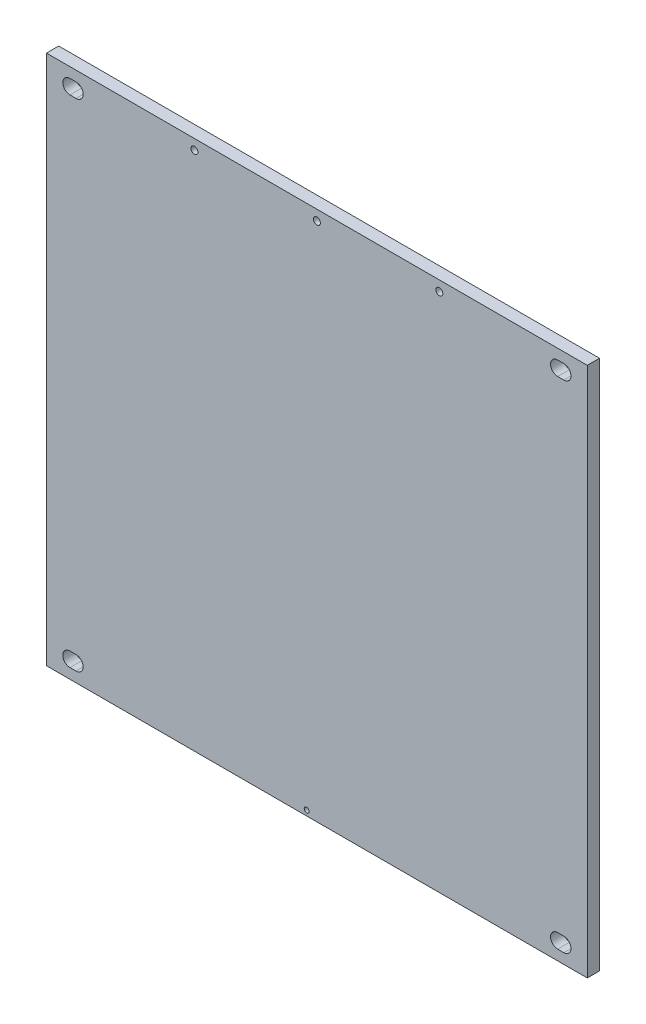
ISO-10303-21;
HEADER;
FILE_DESCRIPTION(('STEP AP214'),'2;1');
FILE_NAME('part.step','',(''),(''),'','','');
FILE_SCHEMA(('AUTOMOTIVE_DESIGN { 1 0 10303 214 1 1 1 1 }'));
ENDSEC;
DATA;
#1=APPLICATION_CONTEXT('core data for automotive mechanical design processes');
#2=APPLICATION_PROTOCOL_DEFINITION('international standard','automotive_design',2000,#1);
#3=PRODUCT_CONTEXT('',#1,'mechanical');
#4=PRODUCT('Part','Part','',(#3));
#5=PRODUCT_RELATED_PRODUCT_CATEGORY('part','',(#4));
#6=PRODUCT_DEFINITION_FORMATION('','',#4);
#7=PRODUCT_DEFINITION_CONTEXT('part definition',#1,'design');
#8=PRODUCT_DEFINITION('design','',#6,#7);
#9=PRODUCT_DEFINITION_SHAPE('','',#8);
#10=(LENGTH_UNIT() NAMED_UNIT(*) SI_UNIT(.MILLI.,.METRE.));
#11=(NAMED_UNIT(*) PLANE_ANGLE_UNIT() SI_UNIT($,.RADIAN.));
#12=(NAMED_UNIT(*) SI_UNIT($,.STERADIAN.) SOLID_ANGLE_UNIT());
#13=UNCERTAINTY_MEASURE_WITH_UNIT(LENGTH_MEASURE(1.E-05),#10,'distance_accuracy_value','');
#14=(GEOMETRIC_REPRESENTATION_CONTEXT(3) GLOBAL_UNCERTAINTY_ASSIGNED_CONTEXT((#13)) GLOBAL_UNIT_ASSIGNED_CONTEXT((#10,
#11,#12)) REPRESENTATION_CONTEXT('',''));
#15=CARTESIAN_POINT('',(0.,0.,0.));
#16=DIRECTION('',(0.,0.,1.));
#17=DIRECTION('',(1.,0.,0.));
#18=AXIS2_PLACEMENT_3D('',#15,#16,#17);
#19=CARTESIAN_POINT('',(0.,0.,0.));
#20=DIRECTION('',(0.,0.,1.));
#21=DIRECTION('',(1.,0.,0.));
#22=AXIS2_PLACEMENT_3D('',#19,#20,#21);
#23=PLANE('',#22);
#24=CARTESIAN_POINT('',(60.,125.,0.));
#25=DIRECTION('',(0.,0.,1.));
#26=DIRECTION('',(1.,0.,0.));
#27=AXIS2_PLACEMENT_3D('',#24,#25,#26);
#28=CIRCLE('',#27,1.69999999999999);
#29=CARTESIAN_POINT('',(61.7,125.,0.));
#30=VERTEX_POINT('',#29);
#31=EDGE_CURVE('E745',#30,#30,#28,.T.);
#32=ORIENTED_EDGE('',*,*,#31,.F.);
#33=EDGE_LOOP('',(#32));
#34=FACE_BOUND('',#33,.T.);
#35=CARTESIAN_POINT('',(0.,125.,0.));
#36=DIRECTION('',(0.,0.,1.));
#37=DIRECTION('',(1.,0.,0.));
#38=AXIS2_PLACEMENT_3D('',#35,#36,#37);
#39=CIRCLE('',#38,1.69999999999999);
#40=CARTESIAN_POINT('',(1.69999999999999,125.,0.));
#41=VERTEX_POINT('',#40);
#42=EDGE_CURVE('E747',#41,#41,#39,.T.);
#43=ORIENTED_EDGE('',*,*,#42,.F.);
#44=EDGE_LOOP('',(#43));
#45=FACE_BOUND('',#44,.T.);
#46=CARTESIAN_POINT('',(-60.,125.,0.));
#47=DIRECTION('',(0.,0.,1.));
#48=DIRECTION('',(1.,0.,0.));
#49=AXIS2_PLACEMENT_3D('',#46,#47,#48);
#50=CIRCLE('',#49,1.69999999999999);
#51=CARTESIAN_POINT('',(-58.3,125.,0.));
#52=VERTEX_POINT('',#51);
#53=EDGE_CURVE('E755',#52,#52,#50,.T.);
#54=ORIENTED_EDGE('',*,*,#53,.F.);
#55=EDGE_LOOP('',(#54));
#56=FACE_BOUND('',#55,.T.);
#57=CARTESIAN_POINT('',(-4.99999999999998,-127.5,0.));
#58=DIRECTION('',(0.,0.,1.));
#59=DIRECTION('',(1.,0.,0.));
#60=AXIS2_PLACEMENT_3D('',#57,#58,#59);
#61=CIRCLE('',#60,1.2);
#62=CARTESIAN_POINT('',(-3.79999999999997,-127.5,0.));
#63=VERTEX_POINT('',#62);
#64=EDGE_CURVE('E761',#63,#63,#61,.T.);
#65=ORIENTED_EDGE('',*,*,#64,.F.);
#66=EDGE_LOOP('',(#65));
#67=FACE_BOUND('',#66,.T.);
#68=CARTESIAN_POINT('',(-118.,-121.5,0.));
#69=DIRECTION('',(0.,0.,-1.));
#70=DIRECTION('',(-1.,0.,0.));
#71=AXIS2_PLACEMENT_3D('',#68,#69,#70);
#72=CIRCLE('',#71,3.49999999999999);
#73=CARTESIAN_POINT('',(-118.,-118.,0.));
#74=VERTEX_POINT('',#73);
#75=CARTESIAN_POINT('',(-118.,-125.,0.));
#76=VERTEX_POINT('',#75);
#77=EDGE_CURVE('E489',#74,#76,#72,.T.);
#78=ORIENTED_EDGE('',*,*,#77,.T.);
#79=DIRECTION('',(1.,0.,0.));
#80=VECTOR('',#79,1.);
#81=CARTESIAN_POINT('',(-121.,-125.,0.));
#82=LINE('',#81,#80);
#83=CARTESIAN_POINT('',(-121.,-125.,0.));
#84=VERTEX_POINT('',#83);
#85=EDGE_CURVE('E473',#84,#76,#82,.T.);
#86=ORIENTED_EDGE('',*,*,#85,.F.);
#87=CARTESIAN_POINT('',(-121.,-121.5,0.));
#88=DIRECTION('',(0.,0.,-1.));
#89=DIRECTION('',(-1.,0.,0.));
#90=AXIS2_PLACEMENT_3D('',#87,#88,#89);
#91=CIRCLE('',#90,3.49999999999999);
#92=CARTESIAN_POINT('',(-121.,-118.,0.));
#93=VERTEX_POINT('',#92);
#94=EDGE_CURVE('E481',#84,#93,#91,.T.);
#95=ORIENTED_EDGE('',*,*,#94,.T.);
#96=DIRECTION('',(1.,0.,0.));
#97=VECTOR('',#96,1.);
#98=CARTESIAN_POINT('',(-121.,-118.,0.));
#99=LINE('',#98,#97);
#100=EDGE_CURVE('E490',#93,#74,#99,.T.);
#101=ORIENTED_EDGE('',*,*,#100,.T.);
#102=EDGE_LOOP('',(#78,#86,#95,#101));
#103=FACE_BOUND('',#102,.T.);
#104=CARTESIAN_POINT('',(121.,-121.5,0.));
#105=DIRECTION('',(0.,0.,-1.));
#106=DIRECTION('',(-1.,0.,0.));
#107=AXIS2_PLACEMENT_3D('',#104,#105,#106);
#108=CIRCLE('',#107,3.49999999999999);
#109=CARTESIAN_POINT('',(121.,-118.,0.));
#110=VERTEX_POINT('',#109);
#111=CARTESIAN_POINT('',(121.,-125.,0.));
#112=VERTEX_POINT('',#111);
#113=EDGE_CURVE('E530',#110,#112,#108,.T.);
#114=ORIENTED_EDGE('',*,*,#113,.T.);
#115=DIRECTION('',(1.,0.,0.));
#116=VECTOR('',#115,1.);
#117=CARTESIAN_POINT('',(118.,-125.,0.));
#118=LINE('',#117,#116);
#119=CARTESIAN_POINT('',(118.,-125.,0.));
#120=VERTEX_POINT('',#119);
#121=EDGE_CURVE('E512',#120,#112,#118,.T.);
#122=ORIENTED_EDGE('',*,*,#121,.F.);
#123=CARTESIAN_POINT('',(118.,-121.5,0.));
#124=DIRECTION('',(0.,0.,-1.));
#125=DIRECTION('',(-1.,0.,0.));
#126=AXIS2_PLACEMENT_3D('',#123,#124,#125);
#127=CIRCLE('',#126,3.49999999999999);
#128=CARTESIAN_POINT('',(118.,-118.,0.));
#129=VERTEX_POINT('',#128);
#130=EDGE_CURVE('E519',#120,#129,#127,.T.);
#131=ORIENTED_EDGE('',*,*,#130,.T.);
#132=DIRECTION('',(1.,0.,0.));
#133=VECTOR('',#132,1.);
#134=CARTESIAN_POINT('',(118.,-118.,0.));
#135=LINE('',#134,#133);
#136=EDGE_CURVE('E509',#129,#110,#135,.T.);
#137=ORIENTED_EDGE('',*,*,#136,.T.);
#138=EDGE_LOOP('',(#114,#122,#131,#137));
#139=FACE_BOUND('',#138,.T.);
#140=CARTESIAN_POINT('',(121.,121.5,0.));
#141=DIRECTION('',(0.,0.,-1.));
#142=DIRECTION('',(-1.,0.,0.));
#143=AXIS2_PLACEMENT_3D('',#140,#141,#142);
#144=CIRCLE('',#143,3.49999999999999);
#145=CARTESIAN_POINT('',(121.,125.,0.));
#146=VERTEX_POINT('',#145);
#147=CARTESIAN_POINT('',(121.,118.,0.));
#148=VERTEX_POINT('',#147);
#149=EDGE_CURVE('E561',#146,#148,#144,.T.);
#150=ORIENTED_EDGE('',*,*,#149,.T.);
#151=DIRECTION('',(1.,0.,0.));
#152=VECTOR('',#151,1.);
#153=CARTESIAN_POINT('',(118.,118.,0.));
#154=LINE('',#153,#152);
#155=CARTESIAN_POINT('',(118.,118.,0.));
#156=VERTEX_POINT('',#155);
#157=EDGE_CURVE('E543',#156,#148,#154,.T.);
#158=ORIENTED_EDGE('',*,*,#157,.F.);
#159=CARTESIAN_POINT('',(118.,121.5,0.));
#160=DIRECTION('',(0.,0.,-1.));
#161=DIRECTION('',(-1.,0.,0.));
#162=AXIS2_PLACEMENT_3D('',#159,#160,#161);
#163=CIRCLE('',#162,3.49999999999999);
#164=CARTESIAN_POINT('',(118.,125.,0.));
#165=VERTEX_POINT('',#164);
#166=EDGE_CURVE('E550',#156,#165,#163,.T.);
#167=ORIENTED_EDGE('',*,*,#166,.T.);
#168=DIRECTION('',(1.,0.,0.));
#169=VECTOR('',#168,1.);
#170=CARTESIAN_POINT('',(118.,125.,0.));
#171=LINE('',#170,#169);
#172=EDGE_CURVE('E540',#165,#146,#171,.T.);
#173=ORIENTED_EDGE('',*,*,#172,.T.);
#174=EDGE_LOOP('',(#150,#158,#167,#173));
#175=FACE_BOUND('',#174,.T.);
#176=DIRECTION('',(0.,1.,0.));
#177=VECTOR('',#176,1.);
#178=CARTESIAN_POINT('',(132.5,130.,0.));
#179=LINE('',#178,#177);
#180=CARTESIAN_POINT('',(132.5,-130.,0.));
#181=VERTEX_POINT('',#180);
#182=CARTESIAN_POINT('',(132.5,130.,0.));
#183=VERTEX_POINT('',#182);
#184=EDGE_CURVE('E600',#181,#183,#179,.T.);
#185=ORIENTED_EDGE('',*,*,#184,.T.);
#186=DIRECTION('',(-1.,0.,0.));
#187=VECTOR('',#186,1.);
#188=CARTESIAN_POINT('',(-132.5,130.,0.));
#189=LINE('',#188,#187);
#190=CARTESIAN_POINT('',(-132.5,130.,0.));
#191=VERTEX_POINT('',#190);
#192=EDGE_CURVE('E616',#183,#191,#189,.T.);
#193=ORIENTED_EDGE('',*,*,#192,.T.);
#194=DIRECTION('',(0.,-1.,0.));
#195=VECTOR('',#194,1.);
#196=CARTESIAN_POINT('',(-132.5,130.,0.));
#197=LINE('',#196,#195);
#198=CARTESIAN_POINT('',(-132.5,-130.,0.));
#199=VERTEX_POINT('',#198);
#200=EDGE_CURVE('E619',#191,#199,#197,.T.);
#201=ORIENTED_EDGE('',*,*,#200,.T.);
#202=DIRECTION('',(1.,0.,0.));
#203=VECTOR('',#202,1.);
#204=CARTESIAN_POINT('',(-132.5,-130.,0.));
#205=LINE('',#204,#203);
#206=EDGE_CURVE('E605',#199,#181,#205,.T.);
#207=ORIENTED_EDGE('',*,*,#206,.T.);
#208=EDGE_LOOP('',(#185,#193,#201,#207));
#209=FACE_BOUND('',#208,.T.);
#210=CARTESIAN_POINT('',(-121.,121.5,0.));
#211=DIRECTION('',(0.,0.,-1.));
#212=DIRECTION('',(-1.,0.,0.));
#213=AXIS2_PLACEMENT_3D('',#210,#211,#212);
#214=CIRCLE('',#213,3.49999999999999);
#215=CARTESIAN_POINT('',(-121.,118.,0.));
#216=VERTEX_POINT('',#215);
#217=CARTESIAN_POINT('',(-121.,125.,0.));
#218=VERTEX_POINT('',#217);
#219=EDGE_CURVE('E581',#216,#218,#214,.T.);
#220=ORIENTED_EDGE('',*,*,#219,.T.);
#221=DIRECTION('',(1.,0.,0.));
#222=VECTOR('',#221,1.);
#223=CARTESIAN_POINT('',(-121.,125.,0.));
#224=LINE('',#223,#222);
#225=CARTESIAN_POINT('',(-118.,125.,0.));
#226=VERTEX_POINT('',#225);
#227=EDGE_CURVE('E570',#218,#226,#224,.T.);
#228=ORIENTED_EDGE('',*,*,#227,.T.);
#229=CARTESIAN_POINT('',(-118.,121.5,0.));
#230=DIRECTION('',(0.,0.,-1.));
#231=DIRECTION('',(-1.,0.,0.));
#232=AXIS2_PLACEMENT_3D('',#229,#230,#231);
#233=CIRCLE('',#232,3.49999999999999);
#234=CARTESIAN_POINT('',(-118.,118.,0.));
#235=VERTEX_POINT('',#234);
#236=EDGE_CURVE('E591',#226,#235,#233,.T.);
#237=ORIENTED_EDGE('',*,*,#236,.T.);
#238=DIRECTION('',(1.,0.,0.));
#239=VECTOR('',#238,1.);
#240=CARTESIAN_POINT('',(-121.,118.,0.));
#241=LINE('',#240,#239);
#242=EDGE_CURVE('E573',#216,#235,#241,.T.);
#243=ORIENTED_EDGE('',*,*,#242,.F.);
#244=EDGE_LOOP('',(#220,#228,#237,#243));
#245=FACE_BOUND('',#244,.T.);
#246=ADVANCED_FACE('F336',(#34,#45,#56,#67,#103,#139,#175,#209,#245),#23,.T.);
#247=CARTESIAN_POINT('',(132.5,130.,-6.));
#248=DIRECTION('',(1.,0.,0.));
#249=DIRECTION('',(0.,1.,0.));
#250=AXIS2_PLACEMENT_3D('',#247,#248,#249);
#251=PLANE('',#250);
#252=ORIENTED_EDGE('',*,*,#184,.F.);
#253=DIRECTION('',(0.,0.,1.));
#254=VECTOR('',#253,1.);
#255=CARTESIAN_POINT('',(132.5,-130.,-6.));
#256=LINE('',#255,#254);
#257=CARTESIAN_POINT('',(132.5,-130.,-6.));
#258=VERTEX_POINT('',#257);
#259=EDGE_CURVE('E13',#258,#181,#256,.T.);
#260=ORIENTED_EDGE('',*,*,#259,.F.);
#261=DIRECTION('',(0.,1.,0.));
#262=VECTOR('',#261,1.);
#263=CARTESIAN_POINT('',(132.5,130.,-6.));
#264=LINE('',#263,#262);
#265=CARTESIAN_POINT('',(132.5,130.,-6.));
#266=VERTEX_POINT('',#265);
#267=EDGE_CURVE('E601',#258,#266,#264,.T.);
#268=ORIENTED_EDGE('',*,*,#267,.T.);
#269=DIRECTION('',(0.,0.,1.));
#270=VECTOR('',#269,1.);
#271=CARTESIAN_POINT('',(132.5,130.,-6.));
#272=LINE('',#271,#270);
#273=EDGE_CURVE('E340',#266,#183,#272,.T.);
#274=ORIENTED_EDGE('',*,*,#273,.T.);
#275=EDGE_LOOP('',(#252,#260,#268,#274));
#276=FACE_BOUND('',#275,.T.);
#277=ADVANCED_FACE('F338',(#276),#251,.T.);
#278=CARTESIAN_POINT('',(-132.5,-130.,-6.));
#279=DIRECTION('',(0.,-1.,0.));
#280=DIRECTION('',(0.,0.,-1.));
#281=AXIS2_PLACEMENT_3D('',#278,#279,#280);
#282=PLANE('',#281);
#283=ORIENTED_EDGE('',*,*,#206,.F.);
#284=DIRECTION('',(0.,0.,1.));
#285=VECTOR('',#284,1.);
#286=CARTESIAN_POINT('',(-132.5,-130.,-6.));
#287=LINE('',#286,#285);
#288=CARTESIAN_POINT('',(-132.5,-130.,-6.));
#289=VERTEX_POINT('',#288);
#290=EDGE_CURVE('E345',#289,#199,#287,.T.);
#291=ORIENTED_EDGE('',*,*,#290,.F.);
#292=DIRECTION('',(1.,0.,0.));
#293=VECTOR('',#292,1.);
#294=CARTESIAN_POINT('',(-132.5,-130.,-6.));
#295=LINE('',#294,#293);
#296=EDGE_CURVE('E611',#289,#258,#295,.T.);
#297=ORIENTED_EDGE('',*,*,#296,.T.);
#298=ORIENTED_EDGE('',*,*,#259,.T.);
#299=EDGE_LOOP('',(#283,#291,#297,#298));
#300=FACE_BOUND('',#299,.T.);
#301=ADVANCED_FACE('F637',(#300),#282,.T.);
#302=CARTESIAN_POINT('',(-132.5,130.,-6.));
#303=DIRECTION('',(-1.,0.,0.));
#304=DIRECTION('',(0.,0.,1.));
#305=AXIS2_PLACEMENT_3D('',#302,#303,#304);
#306=PLANE('',#305);
#307=ORIENTED_EDGE('',*,*,#200,.F.);
#308=DIRECTION('',(0.,0.,1.));
#309=VECTOR('',#308,1.);
#310=CARTESIAN_POINT('',(-132.5,130.,-6.));
#311=LINE('',#310,#309);
#312=CARTESIAN_POINT('',(-132.5,130.,-6.));
#313=VERTEX_POINT('',#312);
#314=EDGE_CURVE('E624',#313,#191,#311,.T.);
#315=ORIENTED_EDGE('',*,*,#314,.F.);
#316=DIRECTION('',(0.,-1.,0.));
#317=VECTOR('',#316,1.);
#318=CARTESIAN_POINT('',(-132.5,130.,-6.));
#319=LINE('',#318,#317);
#320=EDGE_CURVE('E608',#313,#289,#319,.T.);
#321=ORIENTED_EDGE('',*,*,#320,.T.);
#322=ORIENTED_EDGE('',*,*,#290,.T.);
#323=EDGE_LOOP('',(#307,#315,#321,#322));
#324=FACE_BOUND('',#323,.T.);
#325=ADVANCED_FACE('F643',(#324),#306,.T.);
#326=CARTESIAN_POINT('',(-132.5,130.,-6.));
#327=DIRECTION('',(0.,1.,0.));
#328=DIRECTION('',(0.,0.,1.));
#329=AXIS2_PLACEMENT_3D('',#326,#327,#328);
#330=PLANE('',#329);
#331=ORIENTED_EDGE('',*,*,#192,.F.);
#332=ORIENTED_EDGE('',*,*,#273,.F.);
#333=DIRECTION('',(-1.,0.,0.));
#334=VECTOR('',#333,1.);
#335=CARTESIAN_POINT('',(-132.5,130.,-6.));
#336=LINE('',#335,#334);
#337=EDGE_CURVE('E604',#266,#313,#336,.T.);
#338=ORIENTED_EDGE('',*,*,#337,.T.);
#339=ORIENTED_EDGE('',*,*,#314,.T.);
#340=EDGE_LOOP('',(#331,#332,#338,#339));
#341=FACE_BOUND('',#340,.T.);
#342=ADVANCED_FACE('F632',(#341),#330,.T.);
#343=CARTESIAN_POINT('',(0.,0.,-6.));
#344=DIRECTION('',(0.,0.,1.));
#345=DIRECTION('',(1.,0.,0.));
#346=AXIS2_PLACEMENT_3D('',#343,#344,#345);
#347=PLANE('',#346);
#348=CARTESIAN_POINT('',(60.,125.,-6.));
#349=DIRECTION('',(0.,0.,1.));
#350=DIRECTION('',(1.,0.,0.));
#351=AXIS2_PLACEMENT_3D('',#348,#349,#350);
#352=CIRCLE('',#351,1.7);
#353=CARTESIAN_POINT('',(61.7,125.,-6.));
#354=VERTEX_POINT('',#353);
#355=EDGE_CURVE('E743',#354,#354,#352,.T.);
#356=ORIENTED_EDGE('',*,*,#355,.T.);
#357=EDGE_LOOP('',(#356));
#358=FACE_BOUND('',#357,.T.);
#359=CARTESIAN_POINT('',(0.,125.,-6.));
#360=DIRECTION('',(0.,0.,1.));
#361=DIRECTION('',(1.,0.,0.));
#362=AXIS2_PLACEMENT_3D('',#359,#360,#361);
#363=CIRCLE('',#362,1.7);
#364=CARTESIAN_POINT('',(1.7,125.,-6.));
#365=VERTEX_POINT('',#364);
#366=EDGE_CURVE('E752',#365,#365,#363,.T.);
#367=ORIENTED_EDGE('',*,*,#366,.T.);
#368=EDGE_LOOP('',(#367));
#369=FACE_BOUND('',#368,.T.);
#370=CARTESIAN_POINT('',(-60.,125.,-6.));
#371=DIRECTION('',(0.,0.,1.));
#372=DIRECTION('',(1.,0.,0.));
#373=AXIS2_PLACEMENT_3D('',#370,#371,#372);
#374=CIRCLE('',#373,1.7);
#375=CARTESIAN_POINT('',(-58.3,125.,-6.));
#376=VERTEX_POINT('',#375);
#377=EDGE_CURVE('E758',#376,#376,#374,.T.);
#378=ORIENTED_EDGE('',*,*,#377,.T.);
#379=EDGE_LOOP('',(#378));
#380=FACE_BOUND('',#379,.T.);
#381=CARTESIAN_POINT('',(-4.99999999999998,-127.5,-6.));
#382=DIRECTION('',(0.,0.,1.));
#383=DIRECTION('',(1.,0.,0.));
#384=AXIS2_PLACEMENT_3D('',#381,#382,#383);
#385=CIRCLE('',#384,1.2);
#386=CARTESIAN_POINT('',(-3.79999999999997,-127.5,-6.));
#387=VERTEX_POINT('',#386);
#388=EDGE_CURVE('E762',#387,#387,#385,.T.);
#389=ORIENTED_EDGE('',*,*,#388,.T.);
#390=EDGE_LOOP('',(#389));
#391=FACE_BOUND('',#390,.T.);
#392=DIRECTION('',(1.,0.,0.));
#393=VECTOR('',#392,1.);
#394=CARTESIAN_POINT('',(-121.,-125.,-6.));
#395=LINE('',#394,#393);
#396=CARTESIAN_POINT('',(-121.,-125.,-6.));
#397=VERTEX_POINT('',#396);
#398=CARTESIAN_POINT('',(-118.,-125.,-6.));
#399=VERTEX_POINT('',#398);
#400=EDGE_CURVE('E476',#397,#399,#395,.T.);
#401=ORIENTED_EDGE('',*,*,#400,.T.);
#402=CARTESIAN_POINT('',(-118.,-121.5,-6.));
#403=DIRECTION('',(0.,0.,-1.));
#404=DIRECTION('',(-1.,0.,0.));
#405=AXIS2_PLACEMENT_3D('',#402,#403,#404);
#406=CIRCLE('',#405,3.49999999999999);
#407=CARTESIAN_POINT('',(-118.,-118.,-6.));
#408=VERTEX_POINT('',#407);
#409=EDGE_CURVE('E478',#408,#399,#406,.T.);
#410=ORIENTED_EDGE('',*,*,#409,.F.);
#411=DIRECTION('',(1.,0.,0.));
#412=VECTOR('',#411,1.);
#413=CARTESIAN_POINT('',(-121.,-118.,-6.));
#414=LINE('',#413,#412);
#415=CARTESIAN_POINT('',(-121.,-118.,-6.));
#416=VERTEX_POINT('',#415);
#417=EDGE_CURVE('E493',#416,#408,#414,.T.);
#418=ORIENTED_EDGE('',*,*,#417,.F.);
#419=CARTESIAN_POINT('',(-121.,-121.5,-6.));
#420=DIRECTION('',(0.,0.,-1.));
#421=DIRECTION('',(-1.,0.,0.));
#422=AXIS2_PLACEMENT_3D('',#419,#420,#421);
#423=CIRCLE('',#422,3.49999999999999);
#424=EDGE_CURVE('E485',#397,#416,#423,.T.);
#425=ORIENTED_EDGE('',*,*,#424,.F.);
#426=EDGE_LOOP('',(#401,#410,#418,#425));
#427=FACE_BOUND('',#426,.T.);
#428=DIRECTION('',(1.,0.,0.));
#429=VECTOR('',#428,1.);
#430=CARTESIAN_POINT('',(118.,-125.,-6.));
#431=LINE('',#430,#429);
#432=CARTESIAN_POINT('',(118.,-125.,-6.));
#433=VERTEX_POINT('',#432);
#434=CARTESIAN_POINT('',(121.,-125.,-6.));
#435=VERTEX_POINT('',#434);
#436=EDGE_CURVE('E514',#433,#435,#431,.T.);
#437=ORIENTED_EDGE('',*,*,#436,.T.);
#438=CARTESIAN_POINT('',(121.,-121.5,-6.));
#439=DIRECTION('',(0.,0.,-1.));
#440=DIRECTION('',(-1.,0.,0.));
#441=AXIS2_PLACEMENT_3D('',#438,#439,#440);
#442=CIRCLE('',#441,3.49999999999999);
#443=CARTESIAN_POINT('',(121.,-118.,-6.));
#444=VERTEX_POINT('',#443);
#445=EDGE_CURVE('E527',#444,#435,#442,.T.);
#446=ORIENTED_EDGE('',*,*,#445,.F.);
#447=DIRECTION('',(1.,0.,0.));
#448=VECTOR('',#447,1.);
#449=CARTESIAN_POINT('',(118.,-118.,-6.));
#450=LINE('',#449,#448);
#451=CARTESIAN_POINT('',(118.,-118.,-6.));
#452=VERTEX_POINT('',#451);
#453=EDGE_CURVE('E507',#452,#444,#450,.T.);
#454=ORIENTED_EDGE('',*,*,#453,.F.);
#455=CARTESIAN_POINT('',(118.,-121.5,-6.));
#456=DIRECTION('',(0.,0.,-1.));
#457=DIRECTION('',(-1.,0.,0.));
#458=AXIS2_PLACEMENT_3D('',#455,#456,#457);
#459=CIRCLE('',#458,3.49999999999999);
#460=EDGE_CURVE('E517',#433,#452,#459,.T.);
#461=ORIENTED_EDGE('',*,*,#460,.F.);
#462=EDGE_LOOP('',(#437,#446,#454,#461));
#463=FACE_BOUND('',#462,.T.);
#464=DIRECTION('',(1.,0.,0.));
#465=VECTOR('',#464,1.);
#466=CARTESIAN_POINT('',(118.,118.,-6.));
#467=LINE('',#466,#465);
#468=CARTESIAN_POINT('',(118.,118.,-6.));
#469=VERTEX_POINT('',#468);
#470=CARTESIAN_POINT('',(121.,118.,-6.));
#471=VERTEX_POINT('',#470);
#472=EDGE_CURVE('E545',#469,#471,#467,.T.);
#473=ORIENTED_EDGE('',*,*,#472,.T.);
#474=CARTESIAN_POINT('',(121.,121.5,-6.));
#475=DIRECTION('',(0.,0.,-1.));
#476=DIRECTION('',(-1.,0.,0.));
#477=AXIS2_PLACEMENT_3D('',#474,#475,#476);
#478=CIRCLE('',#477,3.49999999999999);
#479=CARTESIAN_POINT('',(121.,125.,-6.));
#480=VERTEX_POINT('',#479);
#481=EDGE_CURVE('E558',#480,#471,#478,.T.);
#482=ORIENTED_EDGE('',*,*,#481,.F.);
#483=DIRECTION('',(1.,0.,0.));
#484=VECTOR('',#483,1.);
#485=CARTESIAN_POINT('',(118.,125.,-6.));
#486=LINE('',#485,#484);
#487=CARTESIAN_POINT('',(118.,125.,-6.));
#488=VERTEX_POINT('',#487);
#489=EDGE_CURVE('E538',#488,#480,#486,.T.);
#490=ORIENTED_EDGE('',*,*,#489,.F.);
#491=CARTESIAN_POINT('',(118.,121.5,-6.));
#492=DIRECTION('',(0.,0.,-1.));
#493=DIRECTION('',(-1.,0.,0.));
#494=AXIS2_PLACEMENT_3D('',#491,#492,#493);
#495=CIRCLE('',#494,3.49999999999999);
#496=EDGE_CURVE('E548',#469,#488,#495,.T.);
#497=ORIENTED_EDGE('',*,*,#496,.F.);
#498=EDGE_LOOP('',(#473,#482,#490,#497));
#499=FACE_BOUND('',#498,.T.);
#500=DIRECTION('',(1.,0.,0.));
#501=VECTOR('',#500,1.);
#502=CARTESIAN_POINT('',(-121.,118.,-6.));
#503=LINE('',#502,#501);
#504=CARTESIAN_POINT('',(-121.,118.,-6.));
#505=VERTEX_POINT('',#504);
#506=CARTESIAN_POINT('',(-118.,118.,-6.));
#507=VERTEX_POINT('',#506);
#508=EDGE_CURVE('E575',#505,#507,#503,.T.);
#509=ORIENTED_EDGE('',*,*,#508,.T.);
#510=CARTESIAN_POINT('',(-118.,121.5,-6.));
#511=DIRECTION('',(0.,0.,-1.));
#512=DIRECTION('',(-1.,0.,0.));
#513=AXIS2_PLACEMENT_3D('',#510,#511,#512);
#514=CIRCLE('',#513,3.49999999999999);
#515=CARTESIAN_POINT('',(-118.,125.,-6.));
#516=VERTEX_POINT('',#515);
#517=EDGE_CURVE('E589',#516,#507,#514,.T.);
#518=ORIENTED_EDGE('',*,*,#517,.F.);
#519=DIRECTION('',(1.,0.,0.));
#520=VECTOR('',#519,1.);
#521=CARTESIAN_POINT('',(-121.,125.,-6.));
#522=LINE('',#521,#520);
#523=CARTESIAN_POINT('',(-121.,125.,-6.));
#524=VERTEX_POINT('',#523);
#525=EDGE_CURVE('E568',#524,#516,#522,.T.);
#526=ORIENTED_EDGE('',*,*,#525,.F.);
#527=CARTESIAN_POINT('',(-121.,121.5,-6.));
#528=DIRECTION('',(0.,0.,-1.));
#529=DIRECTION('',(-1.,0.,0.));
#530=AXIS2_PLACEMENT_3D('',#527,#528,#529);
#531=CIRCLE('',#530,3.49999999999999);
#532=EDGE_CURVE('E578',#505,#524,#531,.T.);
#533=ORIENTED_EDGE('',*,*,#532,.F.);
#534=EDGE_LOOP('',(#509,#518,#526,#533));
#535=FACE_BOUND('',#534,.T.);
#536=ORIENTED_EDGE('',*,*,#267,.F.);
#537=ORIENTED_EDGE('',*,*,#296,.F.);
#538=ORIENTED_EDGE('',*,*,#320,.F.);
#539=ORIENTED_EDGE('',*,*,#337,.F.);
#540=EDGE_LOOP('',(#536,#537,#538,#539));
#541=FACE_BOUND('',#540,.T.);
#542=ADVANCED_FACE('F640',(#358,#369,#380,#391,#427,#463,#499,#535,#541),#347,.F.);
#543=CARTESIAN_POINT('',(-118.,121.5,-6.));
#544=DIRECTION('',(0.,0.,-1.));
#545=DIRECTION('',(-1.,0.,0.));
#546=AXIS2_PLACEMENT_3D('',#543,#544,#545);
#547=CYLINDRICAL_SURFACE('',#546,3.49999999999999);
#548=ORIENTED_EDGE('',*,*,#236,.F.);
#549=DIRECTION('',(0.,0.,-1.));
#550=VECTOR('',#549,1.);
#551=CARTESIAN_POINT('',(-118.,125.,-6.));
#552=LINE('',#551,#550);
#553=EDGE_CURVE('E597',#516,#226,#552,.F.);
#554=ORIENTED_EDGE('',*,*,#553,.F.);
#555=ORIENTED_EDGE('',*,*,#517,.T.);
#556=DIRECTION('',(0.,0.,-1.));
#557=VECTOR('',#556,1.);
#558=CARTESIAN_POINT('',(-118.,118.,-6.));
#559=LINE('',#558,#557);
#560=EDGE_CURVE('E594',#235,#507,#559,.T.);
#561=ORIENTED_EDGE('',*,*,#560,.F.);
#562=EDGE_LOOP('',(#548,#554,#555,#561));
#563=FACE_BOUND('',#562,.T.);
#564=ADVANCED_FACE('F662',(#563),#547,.F.);
#565=CARTESIAN_POINT('',(-121.,121.5,-6.));
#566=DIRECTION('',(0.,0.,-1.));
#567=DIRECTION('',(-1.,0.,0.));
#568=AXIS2_PLACEMENT_3D('',#565,#566,#567);
#569=CYLINDRICAL_SURFACE('',#568,3.49999999999999);
#570=ORIENTED_EDGE('',*,*,#532,.T.);
#571=DIRECTION('',(0.,0.,-1.));
#572=VECTOR('',#571,1.);
#573=CARTESIAN_POINT('',(-121.,125.,-6.));
#574=LINE('',#573,#572);
#575=EDGE_CURVE('E584',#218,#524,#574,.T.);
#576=ORIENTED_EDGE('',*,*,#575,.F.);
#577=ORIENTED_EDGE('',*,*,#219,.F.);
#578=DIRECTION('',(0.,0.,-1.));
#579=VECTOR('',#578,1.);
#580=CARTESIAN_POINT('',(-121.,118.,-6.));
#581=LINE('',#580,#579);
#582=EDGE_CURVE('E586',#505,#216,#581,.F.);
#583=ORIENTED_EDGE('',*,*,#582,.F.);
#584=EDGE_LOOP('',(#570,#576,#577,#583));
#585=FACE_BOUND('',#584,.T.);
#586=ADVANCED_FACE('F666',(#585),#569,.F.);
#587=CARTESIAN_POINT('',(-121.,118.,-6.));
#588=DIRECTION('',(0.,-1.,0.));
#589=DIRECTION('',(0.,0.,-1.));
#590=AXIS2_PLACEMENT_3D('',#587,#588,#589);
#591=PLANE('',#590);
#592=ORIENTED_EDGE('',*,*,#560,.T.);
#593=ORIENTED_EDGE('',*,*,#508,.F.);
#594=ORIENTED_EDGE('',*,*,#582,.T.);
#595=ORIENTED_EDGE('',*,*,#242,.T.);
#596=EDGE_LOOP('',(#592,#593,#594,#595));
#597=FACE_BOUND('',#596,.T.);
#598=ADVANCED_FACE('F670',(#597),#591,.F.);
#599=CARTESIAN_POINT('',(-121.,125.,-6.));
#600=DIRECTION('',(0.,1.,0.));
#601=DIRECTION('',(0.,0.,1.));
#602=AXIS2_PLACEMENT_3D('',#599,#600,#601);
#603=PLANE('',#602);
#604=ORIENTED_EDGE('',*,*,#553,.T.);
#605=ORIENTED_EDGE('',*,*,#227,.F.);
#606=ORIENTED_EDGE('',*,*,#575,.T.);
#607=ORIENTED_EDGE('',*,*,#525,.T.);
#608=EDGE_LOOP('',(#604,#605,#606,#607));
#609=FACE_BOUND('',#608,.T.);
#610=ADVANCED_FACE('F674',(#609),#603,.F.);
#611=CARTESIAN_POINT('',(121.,121.5,-6.));
#612=DIRECTION('',(0.,0.,-1.));
#613=DIRECTION('',(-1.,0.,0.));
#614=AXIS2_PLACEMENT_3D('',#611,#612,#613);
#615=CYLINDRICAL_SURFACE('',#614,3.49999999999999);
#616=ORIENTED_EDGE('',*,*,#149,.F.);
#617=DIRECTION('',(0.,0.,-1.));
#618=VECTOR('',#617,1.);
#619=CARTESIAN_POINT('',(121.,125.,-6.));
#620=LINE('',#619,#618);
#621=EDGE_CURVE('E566',#480,#146,#620,.F.);
#622=ORIENTED_EDGE('',*,*,#621,.F.);
#623=ORIENTED_EDGE('',*,*,#481,.T.);
#624=DIRECTION('',(0.,0.,-1.));
#625=VECTOR('',#624,1.);
#626=CARTESIAN_POINT('',(121.,118.,-6.));
#627=LINE('',#626,#625);
#628=EDGE_CURVE('E564',#148,#471,#627,.T.);
#629=ORIENTED_EDGE('',*,*,#628,.F.);
#630=EDGE_LOOP('',(#616,#622,#623,#629));
#631=FACE_BOUND('',#630,.T.);
#632=ADVANCED_FACE('F678',(#631),#615,.F.);
#633=CARTESIAN_POINT('',(118.,121.5,-6.));
#634=DIRECTION('',(0.,0.,-1.));
#635=DIRECTION('',(-1.,0.,0.));
#636=AXIS2_PLACEMENT_3D('',#633,#634,#635);
#637=CYLINDRICAL_SURFACE('',#636,3.49999999999999);
#638=ORIENTED_EDGE('',*,*,#496,.T.);
#639=DIRECTION('',(0.,0.,-1.));
#640=VECTOR('',#639,1.);
#641=CARTESIAN_POINT('',(118.,125.,-6.));
#642=LINE('',#641,#640);
#643=EDGE_CURVE('E553',#165,#488,#642,.T.);
#644=ORIENTED_EDGE('',*,*,#643,.F.);
#645=ORIENTED_EDGE('',*,*,#166,.F.);
#646=DIRECTION('',(0.,0.,-1.));
#647=VECTOR('',#646,1.);
#648=CARTESIAN_POINT('',(118.,118.,-6.));
#649=LINE('',#648,#647);
#650=EDGE_CURVE('E556',#469,#156,#649,.F.);
#651=ORIENTED_EDGE('',*,*,#650,.F.);
#652=EDGE_LOOP('',(#638,#644,#645,#651));
#653=FACE_BOUND('',#652,.T.);
#654=ADVANCED_FACE('F682',(#653),#637,.F.);
#655=CARTESIAN_POINT('',(118.,118.,-6.));
#656=DIRECTION('',(0.,-1.,0.));
#657=DIRECTION('',(0.,0.,-1.));
#658=AXIS2_PLACEMENT_3D('',#655,#656,#657);
#659=PLANE('',#658);
#660=ORIENTED_EDGE('',*,*,#628,.T.);
#661=ORIENTED_EDGE('',*,*,#472,.F.);
#662=ORIENTED_EDGE('',*,*,#650,.T.);
#663=ORIENTED_EDGE('',*,*,#157,.T.);
#664=EDGE_LOOP('',(#660,#661,#662,#663));
#665=FACE_BOUND('',#664,.T.);
#666=ADVANCED_FACE('F686',(#665),#659,.F.);
#667=CARTESIAN_POINT('',(118.,125.,-6.));
#668=DIRECTION('',(0.,1.,0.));
#669=DIRECTION('',(0.,0.,1.));
#670=AXIS2_PLACEMENT_3D('',#667,#668,#669);
#671=PLANE('',#670);
#672=ORIENTED_EDGE('',*,*,#621,.T.);
#673=ORIENTED_EDGE('',*,*,#172,.F.);
#674=ORIENTED_EDGE('',*,*,#643,.T.);
#675=ORIENTED_EDGE('',*,*,#489,.T.);
#676=EDGE_LOOP('',(#672,#673,#674,#675));
#677=FACE_BOUND('',#676,.T.);
#678=ADVANCED_FACE('F690',(#677),#671,.F.);
#679=CARTESIAN_POINT('',(121.,-121.5,-6.));
#680=DIRECTION('',(0.,0.,-1.));
#681=DIRECTION('',(-1.,0.,0.));
#682=AXIS2_PLACEMENT_3D('',#679,#680,#681);
#683=CYLINDRICAL_SURFACE('',#682,3.49999999999999);
#684=ORIENTED_EDGE('',*,*,#113,.F.);
#685=DIRECTION('',(0.,0.,-1.));
#686=VECTOR('',#685,1.);
#687=CARTESIAN_POINT('',(121.,-118.,-6.));
#688=LINE('',#687,#686);
#689=EDGE_CURVE('E535',#444,#110,#688,.F.);
#690=ORIENTED_EDGE('',*,*,#689,.F.);
#691=ORIENTED_EDGE('',*,*,#445,.T.);
#692=DIRECTION('',(0.,0.,-1.));
#693=VECTOR('',#692,1.);
#694=CARTESIAN_POINT('',(121.,-125.,-6.));
#695=LINE('',#694,#693);
#696=EDGE_CURVE('E533',#112,#435,#695,.T.);
#697=ORIENTED_EDGE('',*,*,#696,.F.);
#698=EDGE_LOOP('',(#684,#690,#691,#697));
#699=FACE_BOUND('',#698,.T.);
#700=ADVANCED_FACE('F694',(#699),#683,.F.);
#701=CARTESIAN_POINT('',(118.,-121.5,-6.));
#702=DIRECTION('',(0.,0.,-1.));
#703=DIRECTION('',(-1.,0.,0.));
#704=AXIS2_PLACEMENT_3D('',#701,#702,#703);
#705=CYLINDRICAL_SURFACE('',#704,3.49999999999999);
#706=ORIENTED_EDGE('',*,*,#460,.T.);
#707=DIRECTION('',(0.,0.,-1.));
#708=VECTOR('',#707,1.);
#709=CARTESIAN_POINT('',(118.,-118.,-6.));
#710=LINE('',#709,#708);
#711=EDGE_CURVE('E522',#129,#452,#710,.T.);
#712=ORIENTED_EDGE('',*,*,#711,.F.);
#713=ORIENTED_EDGE('',*,*,#130,.F.);
#714=DIRECTION('',(0.,0.,-1.));
#715=VECTOR('',#714,1.);
#716=CARTESIAN_POINT('',(118.,-125.,-6.));
#717=LINE('',#716,#715);
#718=EDGE_CURVE('E525',#433,#120,#717,.F.);
#719=ORIENTED_EDGE('',*,*,#718,.F.);
#720=EDGE_LOOP('',(#706,#712,#713,#719));
#721=FACE_BOUND('',#720,.T.);
#722=ADVANCED_FACE('F698',(#721),#705,.F.);
#723=CARTESIAN_POINT('',(118.,-125.,-6.));
#724=DIRECTION('',(0.,-1.,0.));
#725=DIRECTION('',(0.,0.,-1.));
#726=AXIS2_PLACEMENT_3D('',#723,#724,#725);
#727=PLANE('',#726);
#728=ORIENTED_EDGE('',*,*,#696,.T.);
#729=ORIENTED_EDGE('',*,*,#436,.F.);
#730=ORIENTED_EDGE('',*,*,#718,.T.);
#731=ORIENTED_EDGE('',*,*,#121,.T.);
#732=EDGE_LOOP('',(#728,#729,#730,#731));
#733=FACE_BOUND('',#732,.T.);
#734=ADVANCED_FACE('F702',(#733),#727,.F.);
#735=CARTESIAN_POINT('',(118.,-118.,-6.));
#736=DIRECTION('',(0.,1.,0.));
#737=DIRECTION('',(0.,0.,1.));
#738=AXIS2_PLACEMENT_3D('',#735,#736,#737);
#739=PLANE('',#738);
#740=ORIENTED_EDGE('',*,*,#689,.T.);
#741=ORIENTED_EDGE('',*,*,#136,.F.);
#742=ORIENTED_EDGE('',*,*,#711,.T.);
#743=ORIENTED_EDGE('',*,*,#453,.T.);
#744=EDGE_LOOP('',(#740,#741,#742,#743));
#745=FACE_BOUND('',#744,.T.);
#746=ADVANCED_FACE('F706',(#745),#739,.F.);
#747=CARTESIAN_POINT('',(-118.,-121.5,-6.));
#748=DIRECTION('',(0.,0.,-1.));
#749=DIRECTION('',(-1.,0.,0.));
#750=AXIS2_PLACEMENT_3D('',#747,#748,#749);
#751=CYLINDRICAL_SURFACE('',#750,3.49999999999999);
#752=ORIENTED_EDGE('',*,*,#77,.F.);
#753=DIRECTION('',(0.,0.,-1.));
#754=VECTOR('',#753,1.);
#755=CARTESIAN_POINT('',(-118.,-118.,-6.));
#756=LINE('',#755,#754);
#757=EDGE_CURVE('E504',#408,#74,#756,.F.);
#758=ORIENTED_EDGE('',*,*,#757,.F.);
#759=ORIENTED_EDGE('',*,*,#409,.T.);
#760=DIRECTION('',(0.,0.,-1.));
#761=VECTOR('',#760,1.);
#762=CARTESIAN_POINT('',(-118.,-125.,-6.));
#763=LINE('',#762,#761);
#764=EDGE_CURVE('E502',#76,#399,#763,.T.);
#765=ORIENTED_EDGE('',*,*,#764,.F.);
#766=EDGE_LOOP('',(#752,#758,#759,#765));
#767=FACE_BOUND('',#766,.T.);
#768=ADVANCED_FACE('F710',(#767),#751,.F.);
#769=CARTESIAN_POINT('',(-121.,-121.5,-6.));
#770=DIRECTION('',(0.,0.,-1.));
#771=DIRECTION('',(-1.,0.,0.));
#772=AXIS2_PLACEMENT_3D('',#769,#770,#771);
#773=CYLINDRICAL_SURFACE('',#772,3.49999999999999);
#774=ORIENTED_EDGE('',*,*,#424,.T.);
#775=DIRECTION('',(0.,0.,-1.));
#776=VECTOR('',#775,1.);
#777=CARTESIAN_POINT('',(-121.,-118.,-6.));
#778=LINE('',#777,#776);
#779=EDGE_CURVE('E353',#93,#416,#778,.T.);
#780=ORIENTED_EDGE('',*,*,#779,.F.);
#781=ORIENTED_EDGE('',*,*,#94,.F.);
#782=DIRECTION('',(0.,0.,-1.));
#783=VECTOR('',#782,1.);
#784=CARTESIAN_POINT('',(-121.,-125.,-6.));
#785=LINE('',#784,#783);
#786=EDGE_CURVE('E358',#397,#84,#785,.F.);
#787=ORIENTED_EDGE('',*,*,#786,.F.);
#788=EDGE_LOOP('',(#774,#780,#781,#787));
#789=FACE_BOUND('',#788,.T.);
#790=ADVANCED_FACE('F482',(#789),#773,.F.);
#791=CARTESIAN_POINT('',(-121.,-125.,-6.));
#792=DIRECTION('',(0.,-1.,0.));
#793=DIRECTION('',(0.,0.,-1.));
#794=AXIS2_PLACEMENT_3D('',#791,#792,#793);
#795=PLANE('',#794);
#796=ORIENTED_EDGE('',*,*,#764,.T.);
#797=ORIENTED_EDGE('',*,*,#400,.F.);
#798=ORIENTED_EDGE('',*,*,#786,.T.);
#799=ORIENTED_EDGE('',*,*,#85,.T.);
#800=EDGE_LOOP('',(#796,#797,#798,#799));
#801=FACE_BOUND('',#800,.T.);
#802=ADVANCED_FACE('F471',(#801),#795,.F.);
#803=CARTESIAN_POINT('',(-121.,-118.,-6.));
#804=DIRECTION('',(0.,1.,0.));
#805=DIRECTION('',(0.,0.,1.));
#806=AXIS2_PLACEMENT_3D('',#803,#804,#805);
#807=PLANE('',#806);
#808=ORIENTED_EDGE('',*,*,#757,.T.);
#809=ORIENTED_EDGE('',*,*,#100,.F.);
#810=ORIENTED_EDGE('',*,*,#779,.T.);
#811=ORIENTED_EDGE('',*,*,#417,.T.);
#812=EDGE_LOOP('',(#808,#809,#810,#811));
#813=FACE_BOUND('',#812,.T.);
#814=ADVANCED_FACE('F719',(#813),#807,.F.);
#815=CARTESIAN_POINT('',(-4.99999999999998,-127.5,-6.));
#816=DIRECTION('',(0.,0.,1.));
#817=DIRECTION('',(1.,0.,0.));
#818=AXIS2_PLACEMENT_3D('',#815,#816,#817);
#819=CYLINDRICAL_SURFACE('',#818,1.2);
#820=ORIENTED_EDGE('',*,*,#388,.F.);
#821=EDGE_LOOP('',(#820));
#822=FACE_BOUND('',#821,.T.);
#823=ORIENTED_EDGE('',*,*,#64,.T.);
#824=EDGE_LOOP('',(#823));
#825=FACE_BOUND('',#824,.T.);
#826=ADVANCED_FACE('F722',(#822,#825),#819,.F.);
#827=CARTESIAN_POINT('',(-60.,125.,0.));
#828=DIRECTION('',(0.,0.,1.));
#829=DIRECTION('',(1.,0.,0.));
#830=AXIS2_PLACEMENT_3D('',#827,#828,#829);
#831=CYLINDRICAL_SURFACE('',#830,1.69999999999999);
#832=ORIENTED_EDGE('',*,*,#377,.F.);
#833=EDGE_LOOP('',(#832));
#834=FACE_BOUND('',#833,.T.);
#835=ORIENTED_EDGE('',*,*,#53,.T.);
#836=EDGE_LOOP('',(#835));
#837=FACE_BOUND('',#836,.T.);
#838=ADVANCED_FACE('F726',(#834,#837),#831,.F.);
#839=CARTESIAN_POINT('',(0.,125.,0.));
#840=DIRECTION('',(0.,0.,1.));
#841=DIRECTION('',(1.,0.,0.));
#842=AXIS2_PLACEMENT_3D('',#839,#840,#841);
#843=CYLINDRICAL_SURFACE('',#842,1.69999999999999);
#844=ORIENTED_EDGE('',*,*,#366,.F.);
#845=EDGE_LOOP('',(#844));
#846=FACE_BOUND('',#845,.T.);
#847=ORIENTED_EDGE('',*,*,#42,.T.);
#848=EDGE_LOOP('',(#847));
#849=FACE_BOUND('',#848,.T.);
#850=ADVANCED_FACE('F730',(#846,#849),#843,.F.);
#851=CARTESIAN_POINT('',(60.,125.,0.));
#852=DIRECTION('',(0.,0.,1.));
#853=DIRECTION('',(1.,0.,0.));
#854=AXIS2_PLACEMENT_3D('',#851,#852,#853);
#855=CYLINDRICAL_SURFACE('',#854,1.69999999999999);
#856=ORIENTED_EDGE('',*,*,#355,.F.);
#857=EDGE_LOOP('',(#856));
#858=FACE_BOUND('',#857,.T.);
#859=ORIENTED_EDGE('',*,*,#31,.T.);
#860=EDGE_LOOP('',(#859));
#861=FACE_BOUND('',#860,.T.);
#862=ADVANCED_FACE('F734',(#858,#861),#855,.F.);
#863=CLOSED_SHELL('',(#246,#277,#301,#325,#342,#542,#564,#586,#598,#610,#632,#654,#666,#678,
#700,#722,#734,#746,#768,#790,#802,#814,#826,#838,#850,#862));
#864=MANIFOLD_SOLID_BREP('B2',#863);
#865=ADVANCED_BREP_SHAPE_REPRESENTATION('',(#18,#864),#14);
#866=SHAPE_DEFINITION_REPRESENTATION(#9,#865);
ENDSEC;
END-ISO-10303-21;
